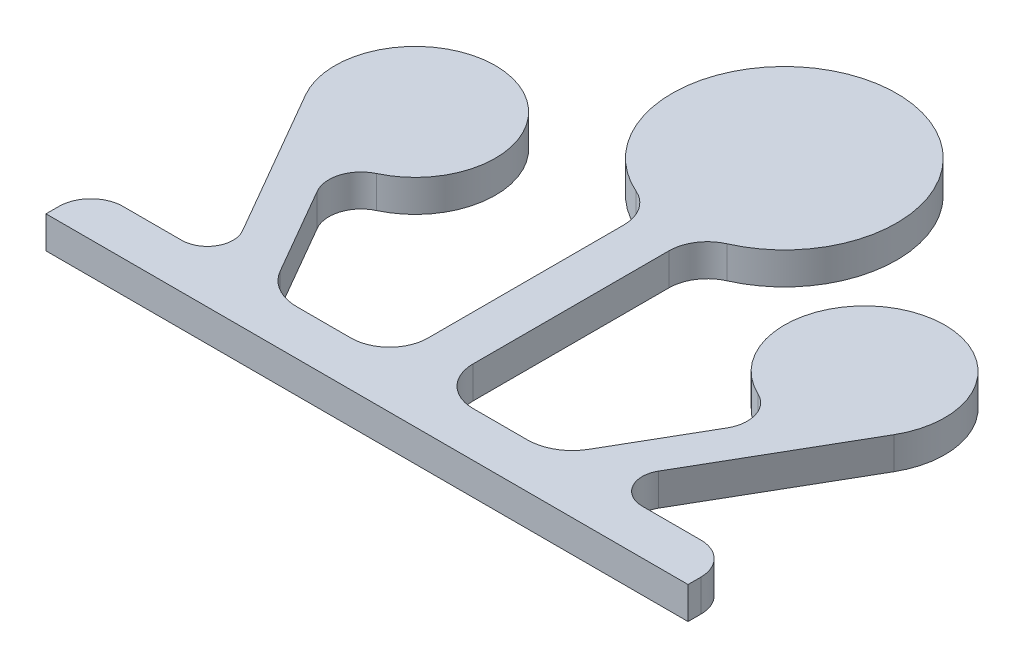
ISO-10303-21;
HEADER;
FILE_DESCRIPTION(('STEP AP214'),'2;1');
FILE_NAME('part.step','',(''),(''),'','','');
FILE_SCHEMA(('AUTOMOTIVE_DESIGN { 1 0 10303 214 1 1 1 1 }'));
ENDSEC;
DATA;
#1=APPLICATION_CONTEXT('core data for automotive mechanical design processes');
#2=APPLICATION_PROTOCOL_DEFINITION('international standard','automotive_design',2000,#1);
#3=PRODUCT_CONTEXT('',#1,'mechanical');
#4=PRODUCT('Part','Part','',(#3));
#5=PRODUCT_RELATED_PRODUCT_CATEGORY('part','',(#4));
#6=PRODUCT_DEFINITION_FORMATION('','',#4);
#7=PRODUCT_DEFINITION_CONTEXT('part definition',#1,'design');
#8=PRODUCT_DEFINITION('design','',#6,#7);
#9=PRODUCT_DEFINITION_SHAPE('','',#8);
#10=(LENGTH_UNIT() NAMED_UNIT(*) SI_UNIT(.MILLI.,.METRE.));
#11=(NAMED_UNIT(*) PLANE_ANGLE_UNIT() SI_UNIT($,.RADIAN.));
#12=(NAMED_UNIT(*) SI_UNIT($,.STERADIAN.) SOLID_ANGLE_UNIT());
#13=UNCERTAINTY_MEASURE_WITH_UNIT(LENGTH_MEASURE(1.E-05),#10,'distance_accuracy_value','');
#14=(GEOMETRIC_REPRESENTATION_CONTEXT(3) GLOBAL_UNCERTAINTY_ASSIGNED_CONTEXT((#13)) GLOBAL_UNIT_ASSIGNED_CONTEXT((#10,
#11,#12)) REPRESENTATION_CONTEXT('',''));
#15=CARTESIAN_POINT('',(0.,0.,0.));
#16=DIRECTION('',(0.,0.,1.));
#17=DIRECTION('',(1.,0.,0.));
#18=AXIS2_PLACEMENT_3D('',#15,#16,#17);
#19=CARTESIAN_POINT('',(-90.,10.,116.));
#20=DIRECTION('',(0.,0.,-1.));
#21=DIRECTION('',(-1.,0.,0.));
#22=AXIS2_PLACEMENT_3D('',#19,#20,#21);
#23=PLANE('',#22);
#24=DIRECTION('',(1.,0.,0.));
#25=VECTOR('',#24,1.);
#26=CARTESIAN_POINT('',(-90.,0.,116.));
#27=LINE('',#26,#25);
#28=CARTESIAN_POINT('',(71.7320508075686,0.,116.));
#29=VERTEX_POINT('',#28);
#30=CARTESIAN_POINT('',(90.,0.,116.));
#31=VERTEX_POINT('',#30);
#32=EDGE_CURVE('E344',#29,#31,#27,.T.);
#33=ORIENTED_EDGE('',*,*,#32,.F.);
#34=DIRECTION('',(0.,-1.,0.));
#35=VECTOR('',#34,1.);
#36=CARTESIAN_POINT('',(71.7320508075686,9.99999999999999,116.));
#37=LINE('',#36,#35);
#38=CARTESIAN_POINT('',(71.7320508075686,9.99999999999999,116.));
#39=VERTEX_POINT('',#38);
#40=EDGE_CURVE('E256',#39,#29,#37,.T.);
#41=ORIENTED_EDGE('',*,*,#40,.F.);
#42=DIRECTION('',(1.,0.,0.));
#43=VECTOR('',#42,1.);
#44=CARTESIAN_POINT('',(-90.,10.,116.));
#45=LINE('',#44,#43);
#46=CARTESIAN_POINT('',(90.,10.,116.));
#47=VERTEX_POINT('',#46);
#48=EDGE_CURVE('E324',#39,#47,#45,.T.);
#49=ORIENTED_EDGE('',*,*,#48,.T.);
#50=DIRECTION('',(0.,-1.,0.));
#51=VECTOR('',#50,1.);
#52=CARTESIAN_POINT('',(90.,10.,116.));
#53=LINE('',#52,#51);
#54=EDGE_CURVE('E355',#47,#31,#53,.T.);
#55=ORIENTED_EDGE('',*,*,#54,.T.);
#56=EDGE_LOOP('',(#33,#41,#49,#55));
#57=FACE_BOUND('',#56,.T.);
#58=ADVANCED_FACE('F37',(#57),#23,.T.);
#59=CARTESIAN_POINT('',(-90.,10.,116.));
#60=VERTEX_POINT('',#59);
#61=CARTESIAN_POINT('',(-71.7320508075686,9.99999999999999,116.));
#62=VERTEX_POINT('',#61);
#63=EDGE_CURVE('E325',#60,#62,#45,.T.);
#64=ORIENTED_EDGE('',*,*,#63,.T.);
#65=DIRECTION('',(0.,-1.,0.));
#66=VECTOR('',#65,1.);
#67=CARTESIAN_POINT('',(-71.7320508075686,9.99999999999999,116.));
#68=LINE('',#67,#66);
#69=CARTESIAN_POINT('',(-71.7320508075686,0.,116.));
#70=VERTEX_POINT('',#69);
#71=EDGE_CURVE('E299',#62,#70,#68,.T.);
#72=ORIENTED_EDGE('',*,*,#71,.T.);
#73=CARTESIAN_POINT('',(-90.,0.,116.));
#74=VERTEX_POINT('',#73);
#75=EDGE_CURVE('E345',#74,#70,#27,.T.);
#76=ORIENTED_EDGE('',*,*,#75,.F.);
#77=DIRECTION('',(0.,-1.,0.));
#78=VECTOR('',#77,1.);
#79=CARTESIAN_POINT('',(-90.,10.,116.));
#80=LINE('',#79,#78);
#81=EDGE_CURVE('E358',#60,#74,#80,.T.);
#82=ORIENTED_EDGE('',*,*,#81,.F.);
#83=EDGE_LOOP('',(#64,#72,#76,#82));
#84=FACE_BOUND('',#83,.T.);
#85=ADVANCED_FACE('F486',(#84),#23,.T.);
#86=CARTESIAN_POINT('',(0.,10.,0.));
#87=DIRECTION('',(0.,-1.,0.));
#88=DIRECTION('',(0.,0.,-1.));
#89=AXIS2_PLACEMENT_3D('',#86,#87,#88);
#90=CYLINDRICAL_SURFACE('',#89,35.);
#91=CARTESIAN_POINT('',(0.,10.,0.));
#92=DIRECTION('',(0.,1.,0.));
#93=DIRECTION('',(0.,0.,1.));
#94=AXIS2_PLACEMENT_3D('',#91,#92,#93);
#95=CIRCLE('',#94,35.);
#96=CARTESIAN_POINT('',(14.1489361702128,10.,32.0126163449857));
#97=VERTEX_POINT('',#96);
#98=CARTESIAN_POINT('',(-14.1489361702128,10.,32.0126163449857));
#99=VERTEX_POINT('',#98);
#100=EDGE_CURVE('E11',#97,#99,#95,.T.);
#101=ORIENTED_EDGE('',*,*,#100,.F.);
#102=DIRECTION('',(0.,-1.,0.));
#103=VECTOR('',#102,1.);
#104=CARTESIAN_POINT('',(14.1489361702128,9.99999999999999,32.0126163449857));
#105=LINE('',#104,#103);
#106=CARTESIAN_POINT('',(14.1489361702128,0.,32.0126163449857));
#107=VERTEX_POINT('',#106);
#108=EDGE_CURVE('E405',#97,#107,#105,.T.);
#109=ORIENTED_EDGE('',*,*,#108,.T.);
#110=CARTESIAN_POINT('',(0.,0.,0.));
#111=DIRECTION('',(0.,1.,0.));
#112=DIRECTION('',(0.,0.,1.));
#113=AXIS2_PLACEMENT_3D('',#110,#111,#112);
#114=CIRCLE('',#113,35.);
#115=CARTESIAN_POINT('',(-14.1489361702128,0.,32.0126163449857));
#116=VERTEX_POINT('',#115);
#117=EDGE_CURVE('E41',#107,#116,#114,.T.);
#118=ORIENTED_EDGE('',*,*,#117,.T.);
#119=DIRECTION('',(0.,-1.,0.));
#120=VECTOR('',#119,1.);
#121=CARTESIAN_POINT('',(-14.1489361702128,9.99999999999999,32.0126163449857));
#122=LINE('',#121,#120);
#123=EDGE_CURVE('E402',#99,#116,#122,.T.);
#124=ORIENTED_EDGE('',*,*,#123,.F.);
#125=EDGE_LOOP('',(#101,#109,#118,#124));
#126=FACE_BOUND('',#125,.T.);
#127=ADVANCED_FACE('F39',(#126),#90,.T.);
#128=CARTESIAN_POINT('',(0.,10.,0.));
#129=DIRECTION('',(0.,1.,0.));
#130=DIRECTION('',(0.,0.,1.));
#131=AXIS2_PLACEMENT_3D('',#128,#129,#130);
#132=PLANE('',#131);
#133=ORIENTED_EDGE('',*,*,#100,.T.);
#134=CARTESIAN_POINT('',(-19.,9.99999999999999,42.9883705204093));
#135=DIRECTION('',(0.,1.,0.));
#136=DIRECTION('',(0.,0.,1.));
#137=AXIS2_PLACEMENT_3D('',#134,#135,#136);
#138=CIRCLE('',#137,12.);
#139=CARTESIAN_POINT('',(-7.,9.99999999999999,42.9883705204093));
#140=VERTEX_POINT('',#139);
#141=EDGE_CURVE('E382',#99,#140,#138,.F.);
#142=ORIENTED_EDGE('',*,*,#141,.T.);
#143=DIRECTION('',(0.,0.,1.));
#144=VECTOR('',#143,1.);
#145=CARTESIAN_POINT('',(-7.,9.99999999999999,0.));
#146=LINE('',#145,#144);
#147=CARTESIAN_POINT('',(-7.00000000000001,9.99999999999999,104.));
#148=VERTEX_POINT('',#147);
#149=EDGE_CURVE('E366',#140,#148,#146,.T.);
#150=ORIENTED_EDGE('',*,*,#149,.T.);
#151=CARTESIAN_POINT('',(-19.,9.99999999999999,104.));
#152=DIRECTION('',(0.,1.,0.));
#153=DIRECTION('',(0.,0.,1.));
#154=AXIS2_PLACEMENT_3D('',#151,#152,#153);
#155=CIRCLE('',#154,12.);
#156=CARTESIAN_POINT('',(-19.,10.,116.));
#157=VERTEX_POINT('',#156);
#158=EDGE_CURVE('E369',#148,#157,#155,.F.);
#159=ORIENTED_EDGE('',*,*,#158,.T.);
#160=CARTESIAN_POINT('',(-35.9363341178118,9.99999999999999,116.));
#161=VERTEX_POINT('',#160);
#162=EDGE_CURVE('E329',#161,#157,#45,.T.);
#163=ORIENTED_EDGE('',*,*,#162,.F.);
#164=CARTESIAN_POINT('',(-35.9363341178118,9.99999999999999,102.));
#165=DIRECTION('',(0.,1.,0.));
#166=DIRECTION('',(0.,0.,1.));
#167=AXIS2_PLACEMENT_3D('',#164,#165,#166);
#168=CIRCLE('',#167,14.);
#169=CARTESIAN_POINT('',(-48.0606897707939,9.99999999999999,109.));
#170=VERTEX_POINT('',#169);
#171=EDGE_CURVE('E284',#161,#170,#168,.F.);
#172=ORIENTED_EDGE('',*,*,#171,.T.);
#173=DIRECTION('',(0.500000000000004,0.,0.866025403784436));
#174=VECTOR('',#173,1.);
#175=CARTESIAN_POINT('',(-83.2439018343474,9.99999999999999,48.0608891324558));
#176=LINE('',#175,#174);
#177=CARTESIAN_POINT('',(-63.8227344750349,9.99999999999999,81.6993377410829));
#178=VERTEX_POINT('',#177);
#179=EDGE_CURVE('E274',#178,#170,#176,.T.);
#180=ORIENTED_EDGE('',*,*,#179,.F.);
#181=CARTESIAN_POINT('',(-55.1624804371905,9.99999999999999,76.6993377410829));
#182=DIRECTION('',(0.,1.,0.));
#183=DIRECTION('',(0.,0.,1.));
#184=AXIS2_PLACEMENT_3D('',#181,#182,#183);
#185=CIRCLE('',#184,10.);
#186=CARTESIAN_POINT('',(-59.4017717408504,10.,67.6423841007735));
#187=VERTEX_POINT('',#186);
#188=EDGE_CURVE('E277',#178,#187,#185,.F.);
#189=ORIENTED_EDGE('',*,*,#188,.T.);
#190=CARTESIAN_POINT('',(-70.,10.,45.));
#191=DIRECTION('',(0.,-1.,0.));
#192=DIRECTION('',(0.,0.,-1.));
#193=AXIS2_PLACEMENT_3D('',#190,#191,#192);
#194=CIRCLE('',#193,25.);
#195=CARTESIAN_POINT('',(-91.650635094611,10.,57.5000000000001));
#196=VERTEX_POINT('',#195);
#197=EDGE_CURVE('E269',#196,#187,#194,.T.);
#198=ORIENTED_EDGE('',*,*,#197,.F.);
#199=DIRECTION('',(0.500000000000004,0.,0.866025403784436));
#200=VECTOR('',#199,1.);
#201=CARTESIAN_POINT('',(-93.6362066797606,9.99999999999999,54.0608891324558));
#202=LINE('',#201,#200);
#203=CARTESIAN_POINT('',(-64.8038475772932,9.99999999999999,104.));
#204=VERTEX_POINT('',#203);
#205=EDGE_CURVE('E280',#196,#204,#202,.T.);
#206=ORIENTED_EDGE('',*,*,#205,.T.);
#207=CARTESIAN_POINT('',(-71.7320508075686,9.99999999999999,108.));
#208=DIRECTION('',(0.,1.,0.));
#209=DIRECTION('',(0.,0.,1.));
#210=AXIS2_PLACEMENT_3D('',#207,#208,#209);
#211=CIRCLE('',#210,8.00000000000001);
#212=EDGE_CURVE('E282',#204,#62,#211,.F.);
#213=ORIENTED_EDGE('',*,*,#212,.T.);
#214=ORIENTED_EDGE('',*,*,#63,.F.);
#215=CARTESIAN_POINT('',(-90.,10.,126.));
#216=DIRECTION('',(0.,1.,0.));
#217=DIRECTION('',(0.,0.,1.));
#218=AXIS2_PLACEMENT_3D('',#215,#216,#217);
#219=CIRCLE('',#218,9.99999999999997);
#220=CARTESIAN_POINT('',(-100.,10.,126.));
#221=VERTEX_POINT('',#220);
#222=EDGE_CURVE('E322',#60,#221,#219,.T.);
#223=ORIENTED_EDGE('',*,*,#222,.T.);
#224=DIRECTION('',(0.,0.,1.));
#225=VECTOR('',#224,1.);
#226=CARTESIAN_POINT('',(-100.,10.,126.));
#227=LINE('',#226,#225);
#228=CARTESIAN_POINT('',(-100.,10.,130.));
#229=VERTEX_POINT('',#228);
#230=EDGE_CURVE('E320',#221,#229,#227,.T.);
#231=ORIENTED_EDGE('',*,*,#230,.T.);
#232=DIRECTION('',(-1.,0.,0.));
#233=VECTOR('',#232,1.);
#234=CARTESIAN_POINT('',(100.,10.,130.));
#235=LINE('',#234,#233);
#236=CARTESIAN_POINT('',(100.,10.,130.));
#237=VERTEX_POINT('',#236);
#238=EDGE_CURVE('E316',#237,#229,#235,.T.);
#239=ORIENTED_EDGE('',*,*,#238,.F.);
#240=DIRECTION('',(0.,0.,1.));
#241=VECTOR('',#240,1.);
#242=CARTESIAN_POINT('',(100.,10.,126.));
#243=LINE('',#242,#241);
#244=CARTESIAN_POINT('',(100.,10.,126.));
#245=VERTEX_POINT('',#244);
#246=EDGE_CURVE('E313',#245,#237,#243,.T.);
#247=ORIENTED_EDGE('',*,*,#246,.F.);
#248=CARTESIAN_POINT('',(90.,10.,126.));
#249=DIRECTION('',(0.,-1.,0.));
#250=DIRECTION('',(0.,0.,-1.));
#251=AXIS2_PLACEMENT_3D('',#248,#249,#250);
#252=CIRCLE('',#251,10.);
#253=EDGE_CURVE('E328',#47,#245,#252,.T.);
#254=ORIENTED_EDGE('',*,*,#253,.F.);
#255=ORIENTED_EDGE('',*,*,#48,.F.);
#256=CARTESIAN_POINT('',(71.7320508075686,9.99999999999999,108.));
#257=DIRECTION('',(0.,1.,0.));
#258=DIRECTION('',(0.,0.,1.));
#259=AXIS2_PLACEMENT_3D('',#256,#257,#258);
#260=CIRCLE('',#259,8.00000000000003);
#261=CARTESIAN_POINT('',(64.8038475772931,9.99999999999999,104.));
#262=VERTEX_POINT('',#261);
#263=EDGE_CURVE('E255',#262,#39,#260,.T.);
#264=ORIENTED_EDGE('',*,*,#263,.F.);
#265=DIRECTION('',(-0.500000000000004,0.,0.866025403784437));
#266=VECTOR('',#265,1.);
#267=CARTESIAN_POINT('',(93.6362066797606,9.99999999999999,54.0608891324557));
#268=LINE('',#267,#266);
#269=CARTESIAN_POINT('',(91.650635094611,10.,57.5));
#270=VERTEX_POINT('',#269);
#271=EDGE_CURVE('E802',#270,#262,#268,.T.);
#272=ORIENTED_EDGE('',*,*,#271,.F.);
#273=CARTESIAN_POINT('',(70.,10.,45.));
#274=DIRECTION('',(0.,1.,0.));
#275=DIRECTION('',(0.,0.,1.));
#276=AXIS2_PLACEMENT_3D('',#273,#274,#275);
#277=CIRCLE('',#276,25.);
#278=CARTESIAN_POINT('',(59.4017717408504,10.,67.6423841007735));
#279=VERTEX_POINT('',#278);
#280=EDGE_CURVE('E228',#270,#279,#277,.T.);
#281=ORIENTED_EDGE('',*,*,#280,.T.);
#282=CARTESIAN_POINT('',(55.1624804371905,9.99999999999999,76.699337741083));
#283=DIRECTION('',(0.,1.,0.));
#284=DIRECTION('',(0.,0.,1.));
#285=AXIS2_PLACEMENT_3D('',#282,#283,#284);
#286=CIRCLE('',#285,10.);
#287=CARTESIAN_POINT('',(63.8227344750349,9.99999999999999,81.6993377410828));
#288=VERTEX_POINT('',#287);
#289=EDGE_CURVE('E801',#288,#279,#286,.T.);
#290=ORIENTED_EDGE('',*,*,#289,.F.);
#291=DIRECTION('',(-0.500000000000003,0.,0.866025403784437));
#292=VECTOR('',#291,1.);
#293=CARTESIAN_POINT('',(83.2439018343473,9.99999999999999,48.0608891324556));
#294=LINE('',#293,#292);
#295=CARTESIAN_POINT('',(48.0606897707938,9.99999999999999,109.));
#296=VERTEX_POINT('',#295);
#297=EDGE_CURVE('E808',#288,#296,#294,.T.);
#298=ORIENTED_EDGE('',*,*,#297,.T.);
#299=CARTESIAN_POINT('',(35.9363341178118,9.99999999999999,102.));
#300=DIRECTION('',(0.,1.,0.));
#301=DIRECTION('',(0.,0.,1.));
#302=AXIS2_PLACEMENT_3D('',#299,#300,#301);
#303=CIRCLE('',#302,14.);
#304=CARTESIAN_POINT('',(35.9363341178118,9.99999999999999,116.));
#305=VERTEX_POINT('',#304);
#306=EDGE_CURVE('E259',#305,#296,#303,.T.);
#307=ORIENTED_EDGE('',*,*,#306,.F.);
#308=CARTESIAN_POINT('',(19.,10.,116.));
#309=VERTEX_POINT('',#308);
#310=EDGE_CURVE('E330',#309,#305,#45,.T.);
#311=ORIENTED_EDGE('',*,*,#310,.F.);
#312=CARTESIAN_POINT('',(19.,9.99999999999999,104.));
#313=DIRECTION('',(0.,1.,0.));
#314=DIRECTION('',(0.,0.,1.));
#315=AXIS2_PLACEMENT_3D('',#312,#313,#314);
#316=CIRCLE('',#315,12.);
#317=CARTESIAN_POINT('',(7.00000000000001,9.99999999999999,104.));
#318=VERTEX_POINT('',#317);
#319=EDGE_CURVE('E373',#318,#309,#316,.T.);
#320=ORIENTED_EDGE('',*,*,#319,.F.);
#321=DIRECTION('',(0.,0.,1.));
#322=VECTOR('',#321,1.);
#323=CARTESIAN_POINT('',(7.,9.99999999999999,0.));
#324=LINE('',#323,#322);
#325=CARTESIAN_POINT('',(7.00000000000001,9.99999999999999,42.9883705204094));
#326=VERTEX_POINT('',#325);
#327=EDGE_CURVE('E376',#326,#318,#324,.T.);
#328=ORIENTED_EDGE('',*,*,#327,.F.);
#329=CARTESIAN_POINT('',(19.,9.99999999999999,42.9883705204094));
#330=DIRECTION('',(0.,1.,0.));
#331=DIRECTION('',(0.,0.,1.));
#332=AXIS2_PLACEMENT_3D('',#329,#330,#331);
#333=CIRCLE('',#332,12.);
#334=EDGE_CURVE('E379',#97,#326,#333,.T.);
#335=ORIENTED_EDGE('',*,*,#334,.F.);
#336=EDGE_LOOP('',(#133,#142,#150,#159,#163,#172,#180,#189,#198,#206,#213,#214,#223,#231,#239,
#247,#254,#255,#264,#272,#281,#290,#298,#307,#311,#320,#328,#335));
#337=FACE_BOUND('',#336,.T.);
#338=ADVANCED_FACE('F435',(#337),#132,.T.);
#339=CARTESIAN_POINT('',(0.,0.,0.));
#340=DIRECTION('',(0.,1.,0.));
#341=DIRECTION('',(0.,0.,1.));
#342=AXIS2_PLACEMENT_3D('',#339,#340,#341);
#343=PLANE('',#342);
#344=ORIENTED_EDGE('',*,*,#117,.F.);
#345=CARTESIAN_POINT('',(19.,0.,42.9883705204094));
#346=DIRECTION('',(0.,1.,0.));
#347=DIRECTION('',(0.,0.,1.));
#348=AXIS2_PLACEMENT_3D('',#345,#346,#347);
#349=CIRCLE('',#348,12.);
#350=CARTESIAN_POINT('',(7.00000000000001,0.,42.9883705204094));
#351=VERTEX_POINT('',#350);
#352=EDGE_CURVE('E396',#107,#351,#349,.T.);
#353=ORIENTED_EDGE('',*,*,#352,.T.);
#354=DIRECTION('',(0.,0.,1.));
#355=VECTOR('',#354,1.);
#356=CARTESIAN_POINT('',(7.,0.,0.));
#357=LINE('',#356,#355);
#358=CARTESIAN_POINT('',(7.00000000000001,0.,104.));
#359=VERTEX_POINT('',#358);
#360=EDGE_CURVE('E393',#351,#359,#357,.T.);
#361=ORIENTED_EDGE('',*,*,#360,.T.);
#362=CARTESIAN_POINT('',(19.,0.,104.));
#363=DIRECTION('',(0.,1.,0.));
#364=DIRECTION('',(0.,0.,1.));
#365=AXIS2_PLACEMENT_3D('',#362,#363,#364);
#366=CIRCLE('',#365,12.);
#367=CARTESIAN_POINT('',(19.,0.,116.));
#368=VERTEX_POINT('',#367);
#369=EDGE_CURVE('E390',#359,#368,#366,.T.);
#370=ORIENTED_EDGE('',*,*,#369,.T.);
#371=CARTESIAN_POINT('',(35.9363341178118,0.,116.));
#372=VERTEX_POINT('',#371);
#373=EDGE_CURVE('E349',#368,#372,#27,.T.);
#374=ORIENTED_EDGE('',*,*,#373,.T.);
#375=CARTESIAN_POINT('',(35.9363341178118,0.,102.));
#376=DIRECTION('',(0.,1.,0.));
#377=DIRECTION('',(0.,0.,1.));
#378=AXIS2_PLACEMENT_3D('',#375,#376,#377);
#379=CIRCLE('',#378,14.);
#380=CARTESIAN_POINT('',(48.0606897707938,0.,109.));
#381=VERTEX_POINT('',#380);
#382=EDGE_CURVE('E252',#372,#381,#379,.T.);
#383=ORIENTED_EDGE('',*,*,#382,.T.);
#384=DIRECTION('',(-0.500000000000003,0.,0.866025403784437));
#385=VECTOR('',#384,1.);
#386=CARTESIAN_POINT('',(83.2439018343473,0.,48.0608891324556));
#387=LINE('',#386,#385);
#388=CARTESIAN_POINT('',(63.8227344750349,0.,81.6993377410828));
#389=VERTEX_POINT('',#388);
#390=EDGE_CURVE('E245',#389,#381,#387,.T.);
#391=ORIENTED_EDGE('',*,*,#390,.F.);
#392=CARTESIAN_POINT('',(55.1624804371905,0.,76.699337741083));
#393=DIRECTION('',(0.,1.,0.));
#394=DIRECTION('',(0.,0.,1.));
#395=AXIS2_PLACEMENT_3D('',#392,#393,#394);
#396=CIRCLE('',#395,10.);
#397=CARTESIAN_POINT('',(59.4017717408504,0.,67.6423841007735));
#398=VERTEX_POINT('',#397);
#399=EDGE_CURVE('E241',#389,#398,#396,.T.);
#400=ORIENTED_EDGE('',*,*,#399,.T.);
#401=CARTESIAN_POINT('',(70.,0.,45.));
#402=DIRECTION('',(0.,1.,0.));
#403=DIRECTION('',(0.,0.,1.));
#404=AXIS2_PLACEMENT_3D('',#401,#402,#403);
#405=CIRCLE('',#404,25.);
#406=CARTESIAN_POINT('',(91.650635094611,0.,57.5));
#407=VERTEX_POINT('',#406);
#408=EDGE_CURVE('E225',#407,#398,#405,.T.);
#409=ORIENTED_EDGE('',*,*,#408,.F.);
#410=DIRECTION('',(-0.500000000000004,0.,0.866025403784437));
#411=VECTOR('',#410,1.);
#412=CARTESIAN_POINT('',(93.6362066797606,0.,54.0608891324557));
#413=LINE('',#412,#411);
#414=CARTESIAN_POINT('',(64.8038475772931,0.,104.));
#415=VERTEX_POINT('',#414);
#416=EDGE_CURVE('E238',#407,#415,#413,.T.);
#417=ORIENTED_EDGE('',*,*,#416,.T.);
#418=CARTESIAN_POINT('',(71.7320508075686,0.,108.));
#419=DIRECTION('',(0.,1.,0.));
#420=DIRECTION('',(0.,0.,1.));
#421=AXIS2_PLACEMENT_3D('',#418,#419,#420);
#422=CIRCLE('',#421,8.00000000000003);
#423=EDGE_CURVE('E52',#415,#29,#422,.T.);
#424=ORIENTED_EDGE('',*,*,#423,.T.);
#425=ORIENTED_EDGE('',*,*,#32,.T.);
#426=CARTESIAN_POINT('',(90.,0.,126.));
#427=DIRECTION('',(0.,-1.,0.));
#428=DIRECTION('',(0.,0.,-1.));
#429=AXIS2_PLACEMENT_3D('',#426,#427,#428);
#430=CIRCLE('',#429,10.);
#431=CARTESIAN_POINT('',(100.,0.,126.));
#432=VERTEX_POINT('',#431);
#433=EDGE_CURVE('E317',#31,#432,#430,.T.);
#434=ORIENTED_EDGE('',*,*,#433,.T.);
#435=DIRECTION('',(0.,0.,1.));
#436=VECTOR('',#435,1.);
#437=CARTESIAN_POINT('',(100.,0.,126.));
#438=LINE('',#437,#436);
#439=CARTESIAN_POINT('',(100.,0.,130.));
#440=VERTEX_POINT('',#439);
#441=EDGE_CURVE('E312',#432,#440,#438,.T.);
#442=ORIENTED_EDGE('',*,*,#441,.T.);
#443=DIRECTION('',(-1.,0.,0.));
#444=VECTOR('',#443,1.);
#445=CARTESIAN_POINT('',(100.,0.,130.));
#446=LINE('',#445,#444);
#447=CARTESIAN_POINT('',(-100.,0.,130.));
#448=VERTEX_POINT('',#447);
#449=EDGE_CURVE('E336',#440,#448,#446,.T.);
#450=ORIENTED_EDGE('',*,*,#449,.T.);
#451=DIRECTION('',(0.,0.,1.));
#452=VECTOR('',#451,1.);
#453=CARTESIAN_POINT('',(-100.,0.,126.));
#454=LINE('',#453,#452);
#455=CARTESIAN_POINT('',(-100.,0.,126.));
#456=VERTEX_POINT('',#455);
#457=EDGE_CURVE('E339',#456,#448,#454,.T.);
#458=ORIENTED_EDGE('',*,*,#457,.F.);
#459=CARTESIAN_POINT('',(-90.,0.,126.));
#460=DIRECTION('',(0.,1.,0.));
#461=DIRECTION('',(0.,0.,1.));
#462=AXIS2_PLACEMENT_3D('',#459,#460,#461);
#463=CIRCLE('',#462,9.99999999999997);
#464=EDGE_CURVE('E342',#74,#456,#463,.T.);
#465=ORIENTED_EDGE('',*,*,#464,.F.);
#466=ORIENTED_EDGE('',*,*,#75,.T.);
#467=CARTESIAN_POINT('',(-71.7320508075686,0.,108.));
#468=DIRECTION('',(0.,1.,0.));
#469=DIRECTION('',(0.,0.,1.));
#470=AXIS2_PLACEMENT_3D('',#467,#468,#469);
#471=CIRCLE('',#470,8.00000000000001);
#472=CARTESIAN_POINT('',(-64.8038475772932,0.,104.));
#473=VERTEX_POINT('',#472);
#474=EDGE_CURVE('E293',#473,#70,#471,.F.);
#475=ORIENTED_EDGE('',*,*,#474,.F.);
#476=DIRECTION('',(0.500000000000004,0.,0.866025403784436));
#477=VECTOR('',#476,1.);
#478=CARTESIAN_POINT('',(-93.6362066797606,0.,54.0608891324558));
#479=LINE('',#478,#477);
#480=CARTESIAN_POINT('',(-91.650635094611,0.,57.5000000000001));
#481=VERTEX_POINT('',#480);
#482=EDGE_CURVE('E291',#481,#473,#479,.T.);
#483=ORIENTED_EDGE('',*,*,#482,.F.);
#484=CARTESIAN_POINT('',(-70.,0.,45.));
#485=DIRECTION('',(0.,-1.,0.));
#486=DIRECTION('',(0.,0.,-1.));
#487=AXIS2_PLACEMENT_3D('',#484,#485,#486);
#488=CIRCLE('',#487,25.);
#489=CARTESIAN_POINT('',(-59.4017717408504,0.,67.6423841007735));
#490=VERTEX_POINT('',#489);
#491=EDGE_CURVE('E268',#481,#490,#488,.T.);
#492=ORIENTED_EDGE('',*,*,#491,.T.);
#493=CARTESIAN_POINT('',(-55.1624804371905,0.,76.6993377410829));
#494=DIRECTION('',(0.,1.,0.));
#495=DIRECTION('',(0.,0.,1.));
#496=AXIS2_PLACEMENT_3D('',#493,#494,#495);
#497=CIRCLE('',#496,10.);
#498=CARTESIAN_POINT('',(-63.8227344750349,0.,81.6993377410829));
#499=VERTEX_POINT('',#498);
#500=EDGE_CURVE('E288',#499,#490,#497,.F.);
#501=ORIENTED_EDGE('',*,*,#500,.F.);
#502=DIRECTION('',(0.500000000000004,0.,0.866025403784436));
#503=VECTOR('',#502,1.);
#504=CARTESIAN_POINT('',(-83.2439018343474,0.,48.0608891324558));
#505=LINE('',#504,#503);
#506=CARTESIAN_POINT('',(-48.0606897707939,0.,109.));
#507=VERTEX_POINT('',#506);
#508=EDGE_CURVE('E271',#499,#507,#505,.T.);
#509=ORIENTED_EDGE('',*,*,#508,.T.);
#510=CARTESIAN_POINT('',(-35.9363341178118,0.,102.));
#511=DIRECTION('',(0.,1.,0.));
#512=DIRECTION('',(0.,0.,1.));
#513=AXIS2_PLACEMENT_3D('',#510,#511,#512);
#514=CIRCLE('',#513,14.);
#515=CARTESIAN_POINT('',(-35.9363341178118,0.,116.));
#516=VERTEX_POINT('',#515);
#517=EDGE_CURVE('E59',#516,#507,#514,.F.);
#518=ORIENTED_EDGE('',*,*,#517,.F.);
#519=CARTESIAN_POINT('',(-19.,0.,116.));
#520=VERTEX_POINT('',#519);
#521=EDGE_CURVE('E348',#516,#520,#27,.T.);
#522=ORIENTED_EDGE('',*,*,#521,.T.);
#523=CARTESIAN_POINT('',(-19.,0.,104.));
#524=DIRECTION('',(0.,1.,0.));
#525=DIRECTION('',(0.,0.,1.));
#526=AXIS2_PLACEMENT_3D('',#523,#524,#525);
#527=CIRCLE('',#526,12.);
#528=CARTESIAN_POINT('',(-7.00000000000001,0.,104.));
#529=VERTEX_POINT('',#528);
#530=EDGE_CURVE('E387',#529,#520,#527,.F.);
#531=ORIENTED_EDGE('',*,*,#530,.F.);
#532=DIRECTION('',(0.,0.,1.));
#533=VECTOR('',#532,1.);
#534=CARTESIAN_POINT('',(-7.,0.,0.));
#535=LINE('',#534,#533);
#536=CARTESIAN_POINT('',(-7.,0.,42.9883705204093));
#537=VERTEX_POINT('',#536);
#538=EDGE_CURVE('E354',#537,#529,#535,.T.);
#539=ORIENTED_EDGE('',*,*,#538,.F.);
#540=CARTESIAN_POINT('',(-19.,0.,42.9883705204093));
#541=DIRECTION('',(0.,1.,0.));
#542=DIRECTION('',(0.,0.,1.));
#543=AXIS2_PLACEMENT_3D('',#540,#541,#542);
#544=CIRCLE('',#543,12.);
#545=EDGE_CURVE('E370',#116,#537,#544,.F.);
#546=ORIENTED_EDGE('',*,*,#545,.F.);
#547=EDGE_LOOP('',(#344,#353,#361,#370,#374,#383,#391,#400,#409,#417,#424,#425,#434,#442,#450,
#458,#465,#466,#475,#483,#492,#501,#509,#518,#522,#531,#539,#546));
#548=FACE_BOUND('',#547,.T.);
#549=ADVANCED_FACE('F237',(#548),#343,.F.);
#550=CARTESIAN_POINT('',(-7.,9.99999999999999,0.));
#551=DIRECTION('',(1.,0.,0.));
#552=DIRECTION('',(0.,0.,-1.));
#553=AXIS2_PLACEMENT_3D('',#550,#551,#552);
#554=PLANE('',#553);
#555=ORIENTED_EDGE('',*,*,#538,.T.);
#556=DIRECTION('',(0.,-1.,0.));
#557=VECTOR('',#556,1.);
#558=CARTESIAN_POINT('',(-7.00000000000001,9.99999999999999,104.));
#559=LINE('',#558,#557);
#560=EDGE_CURVE('E418',#148,#529,#559,.T.);
#561=ORIENTED_EDGE('',*,*,#560,.F.);
#562=ORIENTED_EDGE('',*,*,#149,.F.);
#563=DIRECTION('',(0.,-1.,0.));
#564=VECTOR('',#563,1.);
#565=CARTESIAN_POINT('',(-7.,9.99999999999999,42.9883705204093));
#566=LINE('',#565,#564);
#567=EDGE_CURVE('E384',#140,#537,#566,.T.);
#568=ORIENTED_EDGE('',*,*,#567,.T.);
#569=EDGE_LOOP('',(#555,#561,#562,#568));
#570=FACE_BOUND('',#569,.T.);
#571=ADVANCED_FACE('F432',(#570),#554,.F.);
#572=CARTESIAN_POINT('',(-19.,9.99999999999999,104.));
#573=DIRECTION('',(0.,-1.,0.));
#574=DIRECTION('',(0.,0.,-1.));
#575=AXIS2_PLACEMENT_3D('',#572,#573,#574);
#576=CYLINDRICAL_SURFACE('',#575,12.);
#577=ORIENTED_EDGE('',*,*,#530,.T.);
#578=DIRECTION('',(0.,-1.,0.));
#579=VECTOR('',#578,1.);
#580=CARTESIAN_POINT('',(-19.,9.99999999999999,116.));
#581=LINE('',#580,#579);
#582=EDGE_CURVE('E415',#157,#520,#581,.T.);
#583=ORIENTED_EDGE('',*,*,#582,.F.);
#584=ORIENTED_EDGE('',*,*,#158,.F.);
#585=ORIENTED_EDGE('',*,*,#560,.T.);
#586=EDGE_LOOP('',(#577,#583,#584,#585));
#587=FACE_BOUND('',#586,.T.);
#588=ADVANCED_FACE('F476',(#587),#576,.F.);
#589=CARTESIAN_POINT('',(19.,9.99999999999999,104.));
#590=DIRECTION('',(0.,-1.,0.));
#591=DIRECTION('',(0.,0.,-1.));
#592=AXIS2_PLACEMENT_3D('',#589,#590,#591);
#593=CYLINDRICAL_SURFACE('',#592,12.);
#594=ORIENTED_EDGE('',*,*,#369,.F.);
#595=DIRECTION('',(0.,-1.,0.));
#596=VECTOR('',#595,1.);
#597=CARTESIAN_POINT('',(7.00000000000001,9.99999999999999,104.));
#598=LINE('',#597,#596);
#599=EDGE_CURVE('E410',#318,#359,#598,.T.);
#600=ORIENTED_EDGE('',*,*,#599,.F.);
#601=ORIENTED_EDGE('',*,*,#319,.T.);
#602=DIRECTION('',(0.,-1.,0.));
#603=VECTOR('',#602,1.);
#604=CARTESIAN_POINT('',(19.,9.99999999999999,116.));
#605=LINE('',#604,#603);
#606=EDGE_CURVE('E412',#309,#368,#605,.T.);
#607=ORIENTED_EDGE('',*,*,#606,.T.);
#608=EDGE_LOOP('',(#594,#600,#601,#607));
#609=FACE_BOUND('',#608,.T.);
#610=ADVANCED_FACE('F449',(#609),#593,.F.);
#611=CARTESIAN_POINT('',(7.,9.99999999999999,0.));
#612=DIRECTION('',(1.,0.,0.));
#613=DIRECTION('',(0.,0.,-1.));
#614=AXIS2_PLACEMENT_3D('',#611,#612,#613);
#615=PLANE('',#614);
#616=ORIENTED_EDGE('',*,*,#360,.F.);
#617=DIRECTION('',(0.,-1.,0.));
#618=VECTOR('',#617,1.);
#619=CARTESIAN_POINT('',(7.00000000000001,9.99999999999999,42.9883705204094));
#620=LINE('',#619,#618);
#621=EDGE_CURVE('E408',#326,#351,#620,.T.);
#622=ORIENTED_EDGE('',*,*,#621,.F.);
#623=ORIENTED_EDGE('',*,*,#327,.T.);
#624=ORIENTED_EDGE('',*,*,#599,.T.);
#625=EDGE_LOOP('',(#616,#622,#623,#624));
#626=FACE_BOUND('',#625,.T.);
#627=ADVANCED_FACE('F446',(#626),#615,.T.);
#628=CARTESIAN_POINT('',(19.,9.99999999999999,42.9883705204094));
#629=DIRECTION('',(0.,-1.,0.));
#630=DIRECTION('',(0.,0.,-1.));
#631=AXIS2_PLACEMENT_3D('',#628,#629,#630);
#632=CYLINDRICAL_SURFACE('',#631,12.);
#633=ORIENTED_EDGE('',*,*,#352,.F.);
#634=ORIENTED_EDGE('',*,*,#108,.F.);
#635=ORIENTED_EDGE('',*,*,#334,.T.);
#636=ORIENTED_EDGE('',*,*,#621,.T.);
#637=EDGE_LOOP('',(#633,#634,#635,#636));
#638=FACE_BOUND('',#637,.T.);
#639=ADVANCED_FACE('F441',(#638),#632,.F.);
#640=CARTESIAN_POINT('',(-19.,9.99999999999999,42.9883705204093));
#641=DIRECTION('',(0.,-1.,0.));
#642=DIRECTION('',(0.,0.,-1.));
#643=AXIS2_PLACEMENT_3D('',#640,#641,#642);
#644=CYLINDRICAL_SURFACE('',#643,12.);
#645=ORIENTED_EDGE('',*,*,#545,.T.);
#646=ORIENTED_EDGE('',*,*,#567,.F.);
#647=ORIENTED_EDGE('',*,*,#141,.F.);
#648=ORIENTED_EDGE('',*,*,#123,.T.);
#649=EDGE_LOOP('',(#645,#646,#647,#648));
#650=FACE_BOUND('',#649,.T.);
#651=ADVANCED_FACE('F428',(#650),#644,.F.);
#652=DIRECTION('',(0.,-1.,0.));
#653=VECTOR('',#652,1.);
#654=CARTESIAN_POINT('',(-35.9363341178118,9.99999999999999,116.));
#655=LINE('',#654,#653);
#656=EDGE_CURVE('E297',#161,#516,#655,.T.);
#657=ORIENTED_EDGE('',*,*,#656,.F.);
#658=ORIENTED_EDGE('',*,*,#162,.T.);
#659=ORIENTED_EDGE('',*,*,#582,.T.);
#660=ORIENTED_EDGE('',*,*,#521,.F.);
#661=EDGE_LOOP('',(#657,#658,#659,#660));
#662=FACE_BOUND('',#661,.T.);
#663=ADVANCED_FACE('F475',(#662),#23,.T.);
#664=DIRECTION('',(0.,-1.,0.));
#665=VECTOR('',#664,1.);
#666=CARTESIAN_POINT('',(35.9363341178118,9.99999999999999,116.));
#667=LINE('',#666,#665);
#668=EDGE_CURVE('E258',#305,#372,#667,.T.);
#669=ORIENTED_EDGE('',*,*,#668,.T.);
#670=ORIENTED_EDGE('',*,*,#373,.F.);
#671=ORIENTED_EDGE('',*,*,#606,.F.);
#672=ORIENTED_EDGE('',*,*,#310,.T.);
#673=EDGE_LOOP('',(#669,#670,#671,#672));
#674=FACE_BOUND('',#673,.T.);
#675=ADVANCED_FACE('F453',(#674),#23,.T.);
#676=CARTESIAN_POINT('',(100.,10.,126.));
#677=DIRECTION('',(1.,0.,0.));
#678=DIRECTION('',(0.,0.,-1.));
#679=AXIS2_PLACEMENT_3D('',#676,#677,#678);
#680=PLANE('',#679);
#681=ORIENTED_EDGE('',*,*,#441,.F.);
#682=DIRECTION('',(0.,-1.,0.));
#683=VECTOR('',#682,1.);
#684=CARTESIAN_POINT('',(100.,10.,126.));
#685=LINE('',#684,#683);
#686=EDGE_CURVE('E352',#245,#432,#685,.T.);
#687=ORIENTED_EDGE('',*,*,#686,.F.);
#688=ORIENTED_EDGE('',*,*,#246,.T.);
#689=DIRECTION('',(0.,-1.,0.));
#690=VECTOR('',#689,1.);
#691=CARTESIAN_POINT('',(100.,10.,130.));
#692=LINE('',#691,#690);
#693=EDGE_CURVE('E333',#237,#440,#692,.T.);
#694=ORIENTED_EDGE('',*,*,#693,.T.);
#695=EDGE_LOOP('',(#681,#687,#688,#694));
#696=FACE_BOUND('',#695,.T.);
#697=ADVANCED_FACE('F470',(#696),#680,.T.);
#698=CARTESIAN_POINT('',(90.,10.,126.));
#699=DIRECTION('',(0.,-1.,0.));
#700=DIRECTION('',(0.,0.,-1.));
#701=AXIS2_PLACEMENT_3D('',#698,#699,#700);
#702=CYLINDRICAL_SURFACE('',#701,10.);
#703=ORIENTED_EDGE('',*,*,#433,.F.);
#704=ORIENTED_EDGE('',*,*,#54,.F.);
#705=ORIENTED_EDGE('',*,*,#253,.T.);
#706=ORIENTED_EDGE('',*,*,#686,.T.);
#707=EDGE_LOOP('',(#703,#704,#705,#706));
#708=FACE_BOUND('',#707,.T.);
#709=ADVANCED_FACE('F465',(#708),#702,.T.);
#710=CARTESIAN_POINT('',(-90.,10.,126.));
#711=DIRECTION('',(0.,-1.,0.));
#712=DIRECTION('',(0.,0.,-1.));
#713=AXIS2_PLACEMENT_3D('',#710,#711,#712);
#714=CYLINDRICAL_SURFACE('',#713,9.99999999999997);
#715=ORIENTED_EDGE('',*,*,#464,.T.);
#716=DIRECTION('',(0.,-1.,0.));
#717=VECTOR('',#716,1.);
#718=CARTESIAN_POINT('',(-100.,10.,126.));
#719=LINE('',#718,#717);
#720=EDGE_CURVE('E360',#221,#456,#719,.T.);
#721=ORIENTED_EDGE('',*,*,#720,.F.);
#722=ORIENTED_EDGE('',*,*,#222,.F.);
#723=ORIENTED_EDGE('',*,*,#81,.T.);
#724=EDGE_LOOP('',(#715,#721,#722,#723));
#725=FACE_BOUND('',#724,.T.);
#726=ADVANCED_FACE('F710',(#725),#714,.T.);
#727=CARTESIAN_POINT('',(-100.,10.,126.));
#728=DIRECTION('',(1.,0.,0.));
#729=DIRECTION('',(0.,0.,-1.));
#730=AXIS2_PLACEMENT_3D('',#727,#728,#729);
#731=PLANE('',#730);
#732=ORIENTED_EDGE('',*,*,#457,.T.);
#733=DIRECTION('',(0.,-1.,0.));
#734=VECTOR('',#733,1.);
#735=CARTESIAN_POINT('',(-100.,10.,130.));
#736=LINE('',#735,#734);
#737=EDGE_CURVE('E363',#229,#448,#736,.T.);
#738=ORIENTED_EDGE('',*,*,#737,.F.);
#739=ORIENTED_EDGE('',*,*,#230,.F.);
#740=ORIENTED_EDGE('',*,*,#720,.T.);
#741=EDGE_LOOP('',(#732,#738,#739,#740));
#742=FACE_BOUND('',#741,.T.);
#743=ADVANCED_FACE('F715',(#742),#731,.F.);
#744=CARTESIAN_POINT('',(100.,10.,130.));
#745=DIRECTION('',(0.,0.,1.));
#746=DIRECTION('',(1.,0.,0.));
#747=AXIS2_PLACEMENT_3D('',#744,#745,#746);
#748=PLANE('',#747);
#749=ORIENTED_EDGE('',*,*,#449,.F.);
#750=ORIENTED_EDGE('',*,*,#693,.F.);
#751=ORIENTED_EDGE('',*,*,#238,.T.);
#752=ORIENTED_EDGE('',*,*,#737,.T.);
#753=EDGE_LOOP('',(#749,#750,#751,#752));
#754=FACE_BOUND('',#753,.T.);
#755=ADVANCED_FACE('F532',(#754),#748,.T.);
#756=CARTESIAN_POINT('',(-83.2439018343474,9.99999999999999,48.0608891324558));
#757=DIRECTION('',(0.866025403784436,0.,-0.500000000000004));
#758=DIRECTION('',(-0.500000000000004,0.,-0.866025403784436));
#759=AXIS2_PLACEMENT_3D('',#756,#757,#758);
#760=PLANE('',#759);
#761=ORIENTED_EDGE('',*,*,#508,.F.);
#762=DIRECTION('',(0.,-1.,0.));
#763=VECTOR('',#762,1.);
#764=CARTESIAN_POINT('',(-63.8227344750349,9.99999999999999,81.6993377410829));
#765=LINE('',#764,#763);
#766=EDGE_CURVE('E310',#178,#499,#765,.T.);
#767=ORIENTED_EDGE('',*,*,#766,.F.);
#768=ORIENTED_EDGE('',*,*,#179,.T.);
#769=DIRECTION('',(0.,-1.,0.));
#770=VECTOR('',#769,1.);
#771=CARTESIAN_POINT('',(-48.0606897707939,9.99999999999999,109.));
#772=LINE('',#771,#770);
#773=EDGE_CURVE('E286',#170,#507,#772,.T.);
#774=ORIENTED_EDGE('',*,*,#773,.T.);
#775=EDGE_LOOP('',(#761,#767,#768,#774));
#776=FACE_BOUND('',#775,.T.);
#777=ADVANCED_FACE('F526',(#776),#760,.T.);
#778=CARTESIAN_POINT('',(-55.1624804371905,9.99999999999999,76.6993377410829));
#779=DIRECTION('',(0.,-1.,0.));
#780=DIRECTION('',(0.,0.,-1.));
#781=AXIS2_PLACEMENT_3D('',#778,#779,#780);
#782=CYLINDRICAL_SURFACE('',#781,10.);
#783=ORIENTED_EDGE('',*,*,#500,.T.);
#784=DIRECTION('',(0.,-1.,0.));
#785=VECTOR('',#784,1.);
#786=CARTESIAN_POINT('',(-59.4017717408504,9.99999999999999,67.6423841007735));
#787=LINE('',#786,#785);
#788=EDGE_CURVE('E308',#187,#490,#787,.T.);
#789=ORIENTED_EDGE('',*,*,#788,.F.);
#790=ORIENTED_EDGE('',*,*,#188,.F.);
#791=ORIENTED_EDGE('',*,*,#766,.T.);
#792=EDGE_LOOP('',(#783,#789,#790,#791));
#793=FACE_BOUND('',#792,.T.);
#794=ADVANCED_FACE('F531',(#793),#782,.F.);
#795=CARTESIAN_POINT('',(-93.6362066797606,9.99999999999999,54.0608891324558));
#796=DIRECTION('',(0.866025403784436,0.,-0.500000000000004));
#797=DIRECTION('',(-0.500000000000004,0.,-0.866025403784436));
#798=AXIS2_PLACEMENT_3D('',#795,#796,#797);
#799=PLANE('',#798);
#800=ORIENTED_EDGE('',*,*,#482,.T.);
#801=DIRECTION('',(0.,-1.,0.));
#802=VECTOR('',#801,1.);
#803=CARTESIAN_POINT('',(-64.8038475772932,9.99999999999999,104.));
#804=LINE('',#803,#802);
#805=EDGE_CURVE('E302',#204,#473,#804,.T.);
#806=ORIENTED_EDGE('',*,*,#805,.F.);
#807=ORIENTED_EDGE('',*,*,#205,.F.);
#808=DIRECTION('',(0.,-1.,0.));
#809=VECTOR('',#808,1.);
#810=CARTESIAN_POINT('',(-91.650635094611,9.99999999999999,57.5000000000001));
#811=LINE('',#810,#809);
#812=EDGE_CURVE('E305',#196,#481,#811,.T.);
#813=ORIENTED_EDGE('',*,*,#812,.T.);
#814=EDGE_LOOP('',(#800,#806,#807,#813));
#815=FACE_BOUND('',#814,.T.);
#816=ADVANCED_FACE('F542',(#815),#799,.F.);
#817=CARTESIAN_POINT('',(-71.7320508075686,9.99999999999999,108.));
#818=DIRECTION('',(0.,-1.,0.));
#819=DIRECTION('',(0.,0.,-1.));
#820=AXIS2_PLACEMENT_3D('',#817,#818,#819);
#821=CYLINDRICAL_SURFACE('',#820,8.00000000000001);
#822=ORIENTED_EDGE('',*,*,#474,.T.);
#823=ORIENTED_EDGE('',*,*,#71,.F.);
#824=ORIENTED_EDGE('',*,*,#212,.F.);
#825=ORIENTED_EDGE('',*,*,#805,.T.);
#826=EDGE_LOOP('',(#822,#823,#824,#825));
#827=FACE_BOUND('',#826,.T.);
#828=ADVANCED_FACE('F551',(#827),#821,.F.);
#829=CARTESIAN_POINT('',(-35.9363341178118,9.99999999999999,102.));
#830=DIRECTION('',(0.,-1.,0.));
#831=DIRECTION('',(0.,0.,-1.));
#832=AXIS2_PLACEMENT_3D('',#829,#830,#831);
#833=CYLINDRICAL_SURFACE('',#832,14.);
#834=ORIENTED_EDGE('',*,*,#517,.T.);
#835=ORIENTED_EDGE('',*,*,#773,.F.);
#836=ORIENTED_EDGE('',*,*,#171,.F.);
#837=ORIENTED_EDGE('',*,*,#656,.T.);
#838=EDGE_LOOP('',(#834,#835,#836,#837));
#839=FACE_BOUND('',#838,.T.);
#840=ADVANCED_FACE('F560',(#839),#833,.F.);
#841=CARTESIAN_POINT('',(-70.,10.,45.));
#842=DIRECTION('',(0.,-1.,0.));
#843=DIRECTION('',(0.,0.,-1.));
#844=AXIS2_PLACEMENT_3D('',#841,#842,#843);
#845=CYLINDRICAL_SURFACE('',#844,25.);
#846=ORIENTED_EDGE('',*,*,#197,.T.);
#847=ORIENTED_EDGE('',*,*,#788,.T.);
#848=ORIENTED_EDGE('',*,*,#491,.F.);
#849=ORIENTED_EDGE('',*,*,#812,.F.);
#850=EDGE_LOOP('',(#846,#847,#848,#849));
#851=FACE_BOUND('',#850,.T.);
#852=ADVANCED_FACE('F569',(#851),#845,.T.);
#853=CARTESIAN_POINT('',(71.7320508075686,9.99999999999999,108.));
#854=DIRECTION('',(0.,-1.,0.));
#855=DIRECTION('',(0.,0.,-1.));
#856=AXIS2_PLACEMENT_3D('',#853,#854,#855);
#857=CYLINDRICAL_SURFACE('',#856,8.00000000000003);
#858=ORIENTED_EDGE('',*,*,#423,.F.);
#859=DIRECTION('',(0.,-1.,0.));
#860=VECTOR('',#859,1.);
#861=CARTESIAN_POINT('',(64.8038475772931,9.99999999999999,104.));
#862=LINE('',#861,#860);
#863=EDGE_CURVE('E233',#262,#415,#862,.T.);
#864=ORIENTED_EDGE('',*,*,#863,.F.);
#865=ORIENTED_EDGE('',*,*,#263,.T.);
#866=ORIENTED_EDGE('',*,*,#40,.T.);
#867=EDGE_LOOP('',(#858,#864,#865,#866));
#868=FACE_BOUND('',#867,.T.);
#869=ADVANCED_FACE('F574',(#868),#857,.F.);
#870=CARTESIAN_POINT('',(93.6362066797606,9.99999999999999,54.0608891324557));
#871=DIRECTION('',(0.866025403784436,0.,0.500000000000004));
#872=DIRECTION('',(0.500000000000004,0.,-0.866025403784437));
#873=AXIS2_PLACEMENT_3D('',#870,#871,#872);
#874=PLANE('',#873);
#875=ORIENTED_EDGE('',*,*,#416,.F.);
#876=DIRECTION('',(0.,-1.,0.));
#877=VECTOR('',#876,1.);
#878=CARTESIAN_POINT('',(91.650635094611,9.99999999999999,57.4999999999999));
#879=LINE('',#878,#877);
#880=EDGE_CURVE('E222',#270,#407,#879,.T.);
#881=ORIENTED_EDGE('',*,*,#880,.F.);
#882=ORIENTED_EDGE('',*,*,#271,.T.);
#883=ORIENTED_EDGE('',*,*,#863,.T.);
#884=EDGE_LOOP('',(#875,#881,#882,#883));
#885=FACE_BOUND('',#884,.T.);
#886=ADVANCED_FACE('F243',(#885),#874,.T.);
#887=CARTESIAN_POINT('',(55.1624804371905,9.99999999999999,76.699337741083));
#888=DIRECTION('',(0.,-1.,0.));
#889=DIRECTION('',(0.,0.,-1.));
#890=AXIS2_PLACEMENT_3D('',#887,#888,#889);
#891=CYLINDRICAL_SURFACE('',#890,10.);
#892=ORIENTED_EDGE('',*,*,#399,.F.);
#893=DIRECTION('',(0.,-1.,0.));
#894=VECTOR('',#893,1.);
#895=CARTESIAN_POINT('',(63.8227344750349,9.99999999999999,81.6993377410828));
#896=LINE('',#895,#894);
#897=EDGE_CURVE('E264',#288,#389,#896,.T.);
#898=ORIENTED_EDGE('',*,*,#897,.F.);
#899=ORIENTED_EDGE('',*,*,#289,.T.);
#900=DIRECTION('',(0.,-1.,0.));
#901=VECTOR('',#900,1.);
#902=CARTESIAN_POINT('',(59.4017717408504,9.99999999999999,67.6423841007735));
#903=LINE('',#902,#901);
#904=EDGE_CURVE('E234',#279,#398,#903,.T.);
#905=ORIENTED_EDGE('',*,*,#904,.T.);
#906=EDGE_LOOP('',(#892,#898,#899,#905));
#907=FACE_BOUND('',#906,.T.);
#908=ADVANCED_FACE('F588',(#907),#891,.F.);
#909=CARTESIAN_POINT('',(83.2439018343473,9.99999999999999,48.0608891324556));
#910=DIRECTION('',(0.866025403784437,0.,0.500000000000003));
#911=DIRECTION('',(0.500000000000003,0.,-0.866025403784437));
#912=AXIS2_PLACEMENT_3D('',#909,#910,#911);
#913=PLANE('',#912);
#914=ORIENTED_EDGE('',*,*,#390,.T.);
#915=DIRECTION('',(0.,-1.,0.));
#916=VECTOR('',#915,1.);
#917=CARTESIAN_POINT('',(48.0606897707938,9.99999999999999,109.));
#918=LINE('',#917,#916);
#919=EDGE_CURVE('E262',#296,#381,#918,.T.);
#920=ORIENTED_EDGE('',*,*,#919,.F.);
#921=ORIENTED_EDGE('',*,*,#297,.F.);
#922=ORIENTED_EDGE('',*,*,#897,.T.);
#923=EDGE_LOOP('',(#914,#920,#921,#922));
#924=FACE_BOUND('',#923,.T.);
#925=ADVANCED_FACE('F596',(#924),#913,.F.);
#926=CARTESIAN_POINT('',(35.9363341178118,9.99999999999999,102.));
#927=DIRECTION('',(0.,-1.,0.));
#928=DIRECTION('',(0.,0.,-1.));
#929=AXIS2_PLACEMENT_3D('',#926,#927,#928);
#930=CYLINDRICAL_SURFACE('',#929,14.);
#931=ORIENTED_EDGE('',*,*,#382,.F.);
#932=ORIENTED_EDGE('',*,*,#668,.F.);
#933=ORIENTED_EDGE('',*,*,#306,.T.);
#934=ORIENTED_EDGE('',*,*,#919,.T.);
#935=EDGE_LOOP('',(#931,#932,#933,#934));
#936=FACE_BOUND('',#935,.T.);
#937=ADVANCED_FACE('F605',(#936),#930,.F.);
#938=CARTESIAN_POINT('',(70.,10.,45.));
#939=DIRECTION('',(0.,-1.,0.));
#940=DIRECTION('',(0.,0.,-1.));
#941=AXIS2_PLACEMENT_3D('',#938,#939,#940);
#942=CYLINDRICAL_SURFACE('',#941,25.);
#943=ORIENTED_EDGE('',*,*,#880,.T.);
#944=ORIENTED_EDGE('',*,*,#408,.T.);
#945=ORIENTED_EDGE('',*,*,#904,.F.);
#946=ORIENTED_EDGE('',*,*,#280,.F.);
#947=EDGE_LOOP('',(#943,#944,#945,#946));
#948=FACE_BOUND('',#947,.T.);
#949=ADVANCED_FACE('F224',(#948),#942,.T.);
#950=CLOSED_SHELL('',(#58,#85,#127,#338,#549,#571,#588,#610,#627,#639,#651,#663,#675,#697,#709,
#726,#743,#755,#777,#794,#816,#828,#840,#852,#869,#886,#908,#925,#937,#949));
#951=MANIFOLD_SOLID_BREP('B2',#950);
#952=ADVANCED_BREP_SHAPE_REPRESENTATION('',(#18,#951),#14);
#953=SHAPE_DEFINITION_REPRESENTATION(#9,#952);
ENDSEC;
END-ISO-10303-21;
